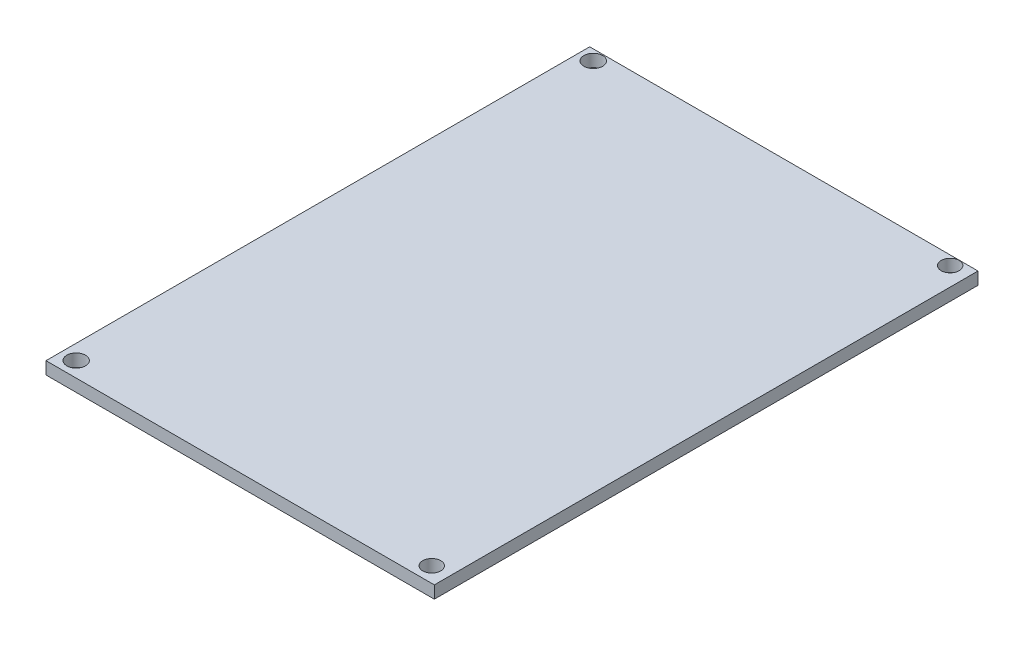
ISO-10303-21;
HEADER;
FILE_DESCRIPTION(('STEP AP214'),'2;1');
FILE_NAME('part.step','',(''),(''),'','','');
FILE_SCHEMA(('AUTOMOTIVE_DESIGN { 1 0 10303 214 1 1 1 1 }'));
ENDSEC;
DATA;
#1=APPLICATION_CONTEXT('core data for automotive mechanical design processes');
#2=APPLICATION_PROTOCOL_DEFINITION('international standard','automotive_design',2000,#1);
#3=PRODUCT_CONTEXT('',#1,'mechanical');
#4=PRODUCT('Part','Part','',(#3));
#5=PRODUCT_RELATED_PRODUCT_CATEGORY('part','',(#4));
#6=PRODUCT_DEFINITION_FORMATION('','',#4);
#7=PRODUCT_DEFINITION_CONTEXT('part definition',#1,'design');
#8=PRODUCT_DEFINITION('design','',#6,#7);
#9=PRODUCT_DEFINITION_SHAPE('','',#8);
#10=(LENGTH_UNIT() NAMED_UNIT(*) SI_UNIT(.MILLI.,.METRE.));
#11=(NAMED_UNIT(*) PLANE_ANGLE_UNIT() SI_UNIT($,.RADIAN.));
#12=(NAMED_UNIT(*) SI_UNIT($,.STERADIAN.) SOLID_ANGLE_UNIT());
#13=UNCERTAINTY_MEASURE_WITH_UNIT(LENGTH_MEASURE(1.E-05),#10,'distance_accuracy_value','');
#14=(GEOMETRIC_REPRESENTATION_CONTEXT(3) GLOBAL_UNCERTAINTY_ASSIGNED_CONTEXT((#13)) GLOBAL_UNIT_ASSIGNED_CONTEXT((#10,
#11,#12)) REPRESENTATION_CONTEXT('',''));
#15=CARTESIAN_POINT('',(0.,0.,0.));
#16=DIRECTION('',(0.,0.,1.));
#17=DIRECTION('',(1.,0.,0.));
#18=AXIS2_PLACEMENT_3D('',#15,#16,#17);
#19=CARTESIAN_POINT('',(20.,1.6,49.8245614035088));
#20=DIRECTION('',(-1.,0.,0.));
#21=DIRECTION('',(0.,0.,1.));
#22=AXIS2_PLACEMENT_3D('',#19,#20,#21);
#23=PLANE('',#22);
#24=DIRECTION('',(0.,0.,-1.));
#25=VECTOR('',#24,1.);
#26=CARTESIAN_POINT('',(20.,0.,49.8245614035088));
#27=LINE('',#26,#25);
#28=CARTESIAN_POINT('',(20.,0.,49.8245614035088));
#29=VERTEX_POINT('',#28);
#30=CARTESIAN_POINT('',(20.,0.,-20.1754385964913));
#31=VERTEX_POINT('',#30);
#32=EDGE_CURVE('E112',#29,#31,#27,.T.);
#33=ORIENTED_EDGE('',*,*,#32,.T.);
#34=DIRECTION('',(0.,-1.,0.));
#35=VECTOR('',#34,1.);
#36=CARTESIAN_POINT('',(20.,1.6,-20.1754385964913));
#37=LINE('',#36,#35);
#38=CARTESIAN_POINT('',(20.,1.6,-20.1754385964913));
#39=VERTEX_POINT('',#38);
#40=EDGE_CURVE('E11',#39,#31,#37,.T.);
#41=ORIENTED_EDGE('',*,*,#40,.F.);
#42=DIRECTION('',(0.,0.,-1.));
#43=VECTOR('',#42,1.);
#44=CARTESIAN_POINT('',(20.,1.6,49.8245614035088));
#45=LINE('',#44,#43);
#46=CARTESIAN_POINT('',(20.,1.6,49.8245614035088));
#47=VERTEX_POINT('',#46);
#48=EDGE_CURVE('E99',#47,#39,#45,.T.);
#49=ORIENTED_EDGE('',*,*,#48,.F.);
#50=DIRECTION('',(0.,-1.,0.));
#51=VECTOR('',#50,1.);
#52=CARTESIAN_POINT('',(20.,1.6,49.8245614035088));
#53=LINE('',#52,#51);
#54=EDGE_CURVE('E108',#47,#29,#53,.T.);
#55=ORIENTED_EDGE('',*,*,#54,.T.);
#56=EDGE_LOOP('',(#33,#41,#49,#55));
#57=FACE_BOUND('',#56,.T.);
#58=ADVANCED_FACE('F46',(#57),#23,.F.);
#59=CARTESIAN_POINT('',(-30.,1.6,-20.1754385964913));
#60=DIRECTION('',(0.,0.,1.));
#61=DIRECTION('',(1.,0.,0.));
#62=AXIS2_PLACEMENT_3D('',#59,#60,#61);
#63=PLANE('',#62);
#64=DIRECTION('',(-1.,0.,0.));
#65=VECTOR('',#64,1.);
#66=CARTESIAN_POINT('',(-30.,0.,-20.1754385964913));
#67=LINE('',#66,#65);
#68=CARTESIAN_POINT('',(-30.,0.,-20.1754385964913));
#69=VERTEX_POINT('',#68);
#70=EDGE_CURVE('E103',#31,#69,#67,.T.);
#71=ORIENTED_EDGE('',*,*,#70,.T.);
#72=DIRECTION('',(0.,-1.,0.));
#73=VECTOR('',#72,1.);
#74=CARTESIAN_POINT('',(-30.,1.6,-20.1754385964913));
#75=LINE('',#74,#73);
#76=CARTESIAN_POINT('',(-30.,1.6,-20.1754385964913));
#77=VERTEX_POINT('',#76);
#78=EDGE_CURVE('E55',#77,#69,#75,.T.);
#79=ORIENTED_EDGE('',*,*,#78,.F.);
#80=DIRECTION('',(-1.,0.,0.));
#81=VECTOR('',#80,1.);
#82=CARTESIAN_POINT('',(-30.,1.6,-20.1754385964913));
#83=LINE('',#82,#81);
#84=EDGE_CURVE('E94',#39,#77,#83,.T.);
#85=ORIENTED_EDGE('',*,*,#84,.F.);
#86=ORIENTED_EDGE('',*,*,#40,.T.);
#87=EDGE_LOOP('',(#71,#79,#85,#86));
#88=FACE_BOUND('',#87,.T.);
#89=ADVANCED_FACE('F102',(#88),#63,.F.);
#90=CARTESIAN_POINT('',(-30.,1.6,49.8245614035088));
#91=DIRECTION('',(1.,0.,0.));
#92=DIRECTION('',(0.,0.,-1.));
#93=AXIS2_PLACEMENT_3D('',#90,#91,#92);
#94=PLANE('',#93);
#95=DIRECTION('',(0.,0.,1.));
#96=VECTOR('',#95,1.);
#97=CARTESIAN_POINT('',(-30.,0.,49.8245614035088));
#98=LINE('',#97,#96);
#99=CARTESIAN_POINT('',(-30.,0.,49.8245614035088));
#100=VERTEX_POINT('',#99);
#101=EDGE_CURVE('E81',#69,#100,#98,.T.);
#102=ORIENTED_EDGE('',*,*,#101,.T.);
#103=DIRECTION('',(0.,-1.,0.));
#104=VECTOR('',#103,1.);
#105=CARTESIAN_POINT('',(-30.,1.6,49.8245614035088));
#106=LINE('',#105,#104);
#107=CARTESIAN_POINT('',(-30.,1.6,49.8245614035088));
#108=VERTEX_POINT('',#107);
#109=EDGE_CURVE('E104',#108,#100,#106,.T.);
#110=ORIENTED_EDGE('',*,*,#109,.F.);
#111=DIRECTION('',(0.,0.,1.));
#112=VECTOR('',#111,1.);
#113=CARTESIAN_POINT('',(-30.,1.6,49.8245614035088));
#114=LINE('',#113,#112);
#115=EDGE_CURVE('E97',#77,#108,#114,.T.);
#116=ORIENTED_EDGE('',*,*,#115,.F.);
#117=ORIENTED_EDGE('',*,*,#78,.T.);
#118=EDGE_LOOP('',(#102,#110,#116,#117));
#119=FACE_BOUND('',#118,.T.);
#120=ADVANCED_FACE('F106',(#119),#94,.F.);
#121=CARTESIAN_POINT('',(-30.,1.6,49.8245614035088));
#122=DIRECTION('',(0.,0.,-1.));
#123=DIRECTION('',(-1.,0.,0.));
#124=AXIS2_PLACEMENT_3D('',#121,#122,#123);
#125=PLANE('',#124);
#126=DIRECTION('',(1.,0.,0.));
#127=VECTOR('',#126,1.);
#128=CARTESIAN_POINT('',(-30.,0.,49.8245614035088));
#129=LINE('',#128,#127);
#130=EDGE_CURVE('E87',#100,#29,#129,.T.);
#131=ORIENTED_EDGE('',*,*,#130,.T.);
#132=ORIENTED_EDGE('',*,*,#54,.F.);
#133=DIRECTION('',(1.,0.,0.));
#134=VECTOR('',#133,1.);
#135=CARTESIAN_POINT('',(-30.,1.6,49.8245614035088));
#136=LINE('',#135,#134);
#137=EDGE_CURVE('E64',#108,#47,#136,.T.);
#138=ORIENTED_EDGE('',*,*,#137,.F.);
#139=ORIENTED_EDGE('',*,*,#109,.T.);
#140=EDGE_LOOP('',(#131,#132,#138,#139));
#141=FACE_BOUND('',#140,.T.);
#142=ADVANCED_FACE('F148',(#141),#125,.F.);
#143=CARTESIAN_POINT('',(0.,1.6,0.));
#144=DIRECTION('',(0.,-1.,0.));
#145=DIRECTION('',(0.,0.,-1.));
#146=AXIS2_PLACEMENT_3D('',#143,#144,#145);
#147=PLANE('',#146);
#148=CARTESIAN_POINT('',(-28.0741537040846,1.6,47.8642162184088));
#149=DIRECTION('',(0.,1.,0.));
#150=DIRECTION('',(0.,0.,1.));
#151=AXIS2_PLACEMENT_3D('',#148,#149,#150);
#152=CIRCLE('',#151,1.20037321418681);
#153=CARTESIAN_POINT('',(-28.0741537040846,1.6,49.0645894325956));
#154=VERTEX_POINT('',#153);
#155=EDGE_CURVE('E256',#154,#154,#152,.T.);
#156=ORIENTED_EDGE('',*,*,#155,.F.);
#157=EDGE_LOOP('',(#156));
#158=FACE_BOUND('',#157,.T.);
#159=CARTESIAN_POINT('',(17.7056159469158,1.6,47.8642162184088));
#160=DIRECTION('',(0.,1.,0.));
#161=DIRECTION('',(0.,0.,1.));
#162=AXIS2_PLACEMENT_3D('',#159,#160,#161);
#163=CIRCLE('',#162,1.15489719999744);
#164=CARTESIAN_POINT('',(17.7056159469158,1.6,49.0191134184063));
#165=VERTEX_POINT('',#164);
#166=EDGE_CURVE('E253',#165,#165,#163,.T.);
#167=ORIENTED_EDGE('',*,*,#166,.F.);
#168=EDGE_LOOP('',(#167));
#169=FACE_BOUND('',#168,.T.);
#170=CARTESIAN_POINT('',(17.6043182550359,1.6,-18.9877179229555));
#171=DIRECTION('',(0.,1.,0.));
#172=DIRECTION('',(0.,0.,1.));
#173=AXIS2_PLACEMENT_3D('',#170,#171,#172);
#174=CIRCLE('',#173,1.1542852228832);
#175=CARTESIAN_POINT('',(17.6043182550359,1.6,-17.8334327000723));
#176=VERTEX_POINT('',#175);
#177=EDGE_CURVE('E255',#176,#176,#174,.T.);
#178=ORIENTED_EDGE('',*,*,#177,.F.);
#179=EDGE_LOOP('',(#178));
#180=FACE_BOUND('',#179,.T.);
#181=CARTESIAN_POINT('',(-28.1905047922333,1.6,-18.8325735429863));
#182=DIRECTION('',(0.,1.,0.));
#183=DIRECTION('',(0.,0.,1.));
#184=AXIS2_PLACEMENT_3D('',#181,#182,#183);
#185=CIRCLE('',#184,1.20669190224482);
#186=CARTESIAN_POINT('',(-28.1905047922333,1.6,-17.6258816407415));
#187=VERTEX_POINT('',#186);
#188=EDGE_CURVE('E124',#187,#187,#185,.T.);
#189=ORIENTED_EDGE('',*,*,#188,.F.);
#190=EDGE_LOOP('',(#189));
#191=FACE_BOUND('',#190,.T.);
#192=ORIENTED_EDGE('',*,*,#48,.T.);
#193=ORIENTED_EDGE('',*,*,#84,.T.);
#194=ORIENTED_EDGE('',*,*,#115,.T.);
#195=ORIENTED_EDGE('',*,*,#137,.T.);
#196=EDGE_LOOP('',(#192,#193,#194,#195));
#197=FACE_BOUND('',#196,.T.);
#198=ADVANCED_FACE('F95',(#158,#169,#180,#191,#197),#147,.F.);
#199=CARTESIAN_POINT('',(0.,0.,0.));
#200=DIRECTION('',(0.,-1.,0.));
#201=DIRECTION('',(0.,0.,-1.));
#202=AXIS2_PLACEMENT_3D('',#199,#200,#201);
#203=PLANE('',#202);
#204=CARTESIAN_POINT('',(-28.0741537040846,0.,47.8642162184088));
#205=DIRECTION('',(0.,-1.,0.));
#206=DIRECTION('',(0.,0.,-1.));
#207=AXIS2_PLACEMENT_3D('',#204,#205,#206);
#208=CIRCLE('',#207,1.20037321418681);
#209=CARTESIAN_POINT('',(-28.0741537040846,0.,46.663843004222));
#210=VERTEX_POINT('',#209);
#211=EDGE_CURVE('E49',#210,#210,#208,.T.);
#212=ORIENTED_EDGE('',*,*,#211,.F.);
#213=EDGE_LOOP('',(#212));
#214=FACE_BOUND('',#213,.T.);
#215=CARTESIAN_POINT('',(17.7056159469158,0.,47.8642162184088));
#216=DIRECTION('',(0.,-1.,0.));
#217=DIRECTION('',(0.,0.,-1.));
#218=AXIS2_PLACEMENT_3D('',#215,#216,#217);
#219=CIRCLE('',#218,1.15489719999744);
#220=CARTESIAN_POINT('',(17.7056159469158,0.,46.7093190184114));
#221=VERTEX_POINT('',#220);
#222=EDGE_CURVE('E126',#221,#221,#219,.T.);
#223=ORIENTED_EDGE('',*,*,#222,.F.);
#224=EDGE_LOOP('',(#223));
#225=FACE_BOUND('',#224,.T.);
#226=CARTESIAN_POINT('',(17.6043182550359,0.,-18.9877179229555));
#227=DIRECTION('',(0.,-1.,0.));
#228=DIRECTION('',(0.,0.,-1.));
#229=AXIS2_PLACEMENT_3D('',#226,#227,#228);
#230=CIRCLE('',#229,1.1542852228832);
#231=CARTESIAN_POINT('',(17.6043182550359,0.,-20.1420031458387));
#232=VERTEX_POINT('',#231);
#233=EDGE_CURVE('E123',#232,#232,#230,.T.);
#234=ORIENTED_EDGE('',*,*,#233,.F.);
#235=EDGE_LOOP('',(#234));
#236=FACE_BOUND('',#235,.T.);
#237=CARTESIAN_POINT('',(-28.1905047922333,0.,-18.8325735429863));
#238=DIRECTION('',(0.,-1.,0.));
#239=DIRECTION('',(0.,0.,-1.));
#240=AXIS2_PLACEMENT_3D('',#237,#238,#239);
#241=CIRCLE('',#240,1.20669190224482);
#242=CARTESIAN_POINT('',(-28.1905047922333,0.,-20.0392654452311));
#243=VERTEX_POINT('',#242);
#244=EDGE_CURVE('E120',#243,#243,#241,.T.);
#245=ORIENTED_EDGE('',*,*,#244,.F.);
#246=EDGE_LOOP('',(#245));
#247=FACE_BOUND('',#246,.T.);
#248=ORIENTED_EDGE('',*,*,#32,.F.);
#249=ORIENTED_EDGE('',*,*,#130,.F.);
#250=ORIENTED_EDGE('',*,*,#101,.F.);
#251=ORIENTED_EDGE('',*,*,#70,.F.);
#252=EDGE_LOOP('',(#248,#249,#250,#251));
#253=FACE_BOUND('',#252,.T.);
#254=ADVANCED_FACE('F136',(#214,#225,#236,#247,#253),#203,.T.);
#255=CARTESIAN_POINT('',(-28.1905047922333,-8.4,-18.8325735429863));
#256=DIRECTION('',(0.,1.,0.));
#257=DIRECTION('',(0.,0.,1.));
#258=AXIS2_PLACEMENT_3D('',#255,#256,#257);
#259=CYLINDRICAL_SURFACE('',#258,1.20669190224482);
#260=ORIENTED_EDGE('',*,*,#244,.T.);
#261=EDGE_LOOP('',(#260));
#262=FACE_BOUND('',#261,.T.);
#263=ORIENTED_EDGE('',*,*,#188,.T.);
#264=EDGE_LOOP('',(#263));
#265=FACE_BOUND('',#264,.T.);
#266=ADVANCED_FACE('F139',(#262,#265),#259,.F.);
#267=CARTESIAN_POINT('',(17.6043182550359,-8.4,-18.9877179229555));
#268=DIRECTION('',(0.,1.,0.));
#269=DIRECTION('',(0.,0.,1.));
#270=AXIS2_PLACEMENT_3D('',#267,#268,#269);
#271=CYLINDRICAL_SURFACE('',#270,1.1542852228832);
#272=ORIENTED_EDGE('',*,*,#233,.T.);
#273=EDGE_LOOP('',(#272));
#274=FACE_BOUND('',#273,.T.);
#275=ORIENTED_EDGE('',*,*,#177,.T.);
#276=EDGE_LOOP('',(#275));
#277=FACE_BOUND('',#276,.T.);
#278=ADVANCED_FACE('F197',(#274,#277),#271,.F.);
#279=CARTESIAN_POINT('',(17.7056159469158,-8.4,47.8642162184088));
#280=DIRECTION('',(0.,1.,0.));
#281=DIRECTION('',(0.,0.,1.));
#282=AXIS2_PLACEMENT_3D('',#279,#280,#281);
#283=CYLINDRICAL_SURFACE('',#282,1.15489719999744);
#284=ORIENTED_EDGE('',*,*,#222,.T.);
#285=EDGE_LOOP('',(#284));
#286=FACE_BOUND('',#285,.T.);
#287=ORIENTED_EDGE('',*,*,#166,.T.);
#288=EDGE_LOOP('',(#287));
#289=FACE_BOUND('',#288,.T.);
#290=ADVANCED_FACE('F208',(#286,#289),#283,.F.);
#291=CARTESIAN_POINT('',(-28.0741537040846,-8.4,47.8642162184088));
#292=DIRECTION('',(0.,1.,0.));
#293=DIRECTION('',(0.,0.,1.));
#294=AXIS2_PLACEMENT_3D('',#291,#292,#293);
#295=CYLINDRICAL_SURFACE('',#294,1.20037321418681);
#296=ORIENTED_EDGE('',*,*,#211,.T.);
#297=EDGE_LOOP('',(#296));
#298=FACE_BOUND('',#297,.T.);
#299=ORIENTED_EDGE('',*,*,#155,.T.);
#300=EDGE_LOOP('',(#299));
#301=FACE_BOUND('',#300,.T.);
#302=ADVANCED_FACE('F133',(#298,#301),#295,.F.);
#303=CLOSED_SHELL('',(#58,#89,#120,#142,#198,#254,#266,#278,#290,#302));
#304=MANIFOLD_SOLID_BREP('B2',#303);
#305=ADVANCED_BREP_SHAPE_REPRESENTATION('',(#18,#304),#14);
#306=SHAPE_DEFINITION_REPRESENTATION(#9,#305);
ENDSEC;
END-ISO-10303-21;
